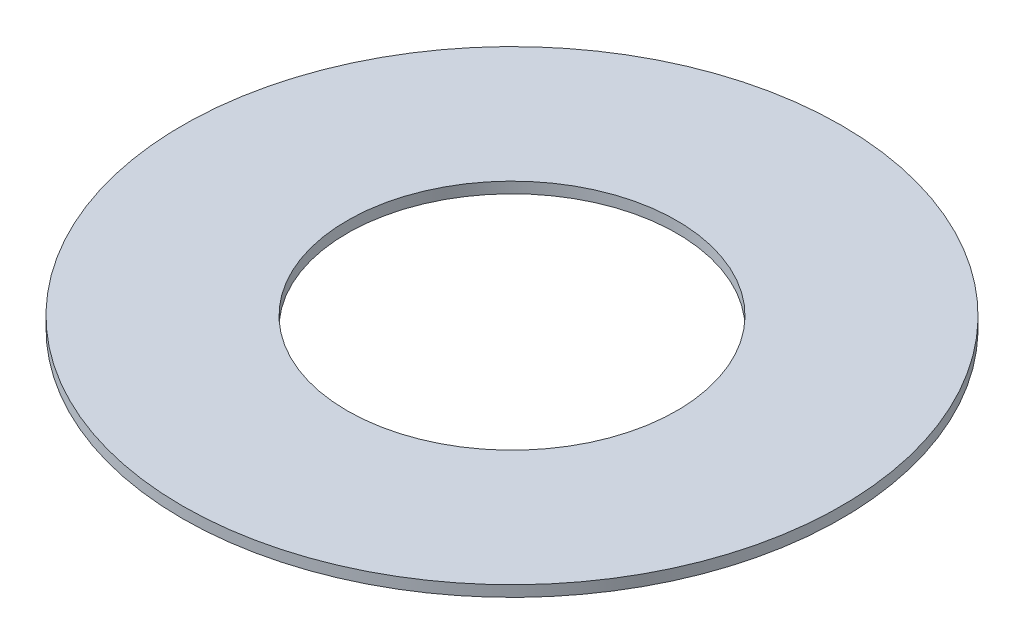
ISO-10303-21;
HEADER;
FILE_DESCRIPTION(('STEP AP214'),'2;1');
FILE_NAME('part.step','',(''),(''),'','','');
FILE_SCHEMA(('AUTOMOTIVE_DESIGN { 1 0 10303 214 1 1 1 1 }'));
ENDSEC;
DATA;
#1=APPLICATION_CONTEXT('core data for automotive mechanical design processes');
#2=APPLICATION_PROTOCOL_DEFINITION('international standard','automotive_design',2000,#1);
#3=PRODUCT_CONTEXT('',#1,'mechanical');
#4=PRODUCT('Part','Part','',(#3));
#5=PRODUCT_RELATED_PRODUCT_CATEGORY('part','',(#4));
#6=PRODUCT_DEFINITION_FORMATION('','',#4);
#7=PRODUCT_DEFINITION_CONTEXT('part definition',#1,'design');
#8=PRODUCT_DEFINITION('design','',#6,#7);
#9=PRODUCT_DEFINITION_SHAPE('','',#8);
#10=(LENGTH_UNIT() NAMED_UNIT(*) SI_UNIT(.MILLI.,.METRE.));
#11=(NAMED_UNIT(*) PLANE_ANGLE_UNIT() SI_UNIT($,.RADIAN.));
#12=(NAMED_UNIT(*) SI_UNIT($,.STERADIAN.) SOLID_ANGLE_UNIT());
#13=UNCERTAINTY_MEASURE_WITH_UNIT(LENGTH_MEASURE(1.E-05),#10,'distance_accuracy_value','');
#14=(GEOMETRIC_REPRESENTATION_CONTEXT(3) GLOBAL_UNCERTAINTY_ASSIGNED_CONTEXT((#13)) GLOBAL_UNIT_ASSIGNED_CONTEXT((#10,
#11,#12)) REPRESENTATION_CONTEXT('',''));
#15=CARTESIAN_POINT('',(0.,0.,0.));
#16=DIRECTION('',(0.,0.,1.));
#17=DIRECTION('',(1.,0.,0.));
#18=AXIS2_PLACEMENT_3D('',#15,#16,#17);
#19=CARTESIAN_POINT('',(0.,0.199999999999978,0.));
#20=DIRECTION('',(0.,-1.,0.));
#21=DIRECTION('',(0.,0.,-1.));
#22=AXIS2_PLACEMENT_3D('',#19,#20,#21);
#23=CYLINDRICAL_SURFACE('',#22,6.);
#24=CARTESIAN_POINT('',(0.,0.199999999999978,0.));
#25=DIRECTION('',(0.,1.,0.));
#26=DIRECTION('',(0.,0.,1.));
#27=AXIS2_PLACEMENT_3D('',#24,#25,#26);
#28=CIRCLE('',#27,6.);
#29=CARTESIAN_POINT('',(0.,0.199999999999978,6.));
#30=VERTEX_POINT('',#29);
#31=EDGE_CURVE('E10',#30,#30,#28,.T.);
#32=ORIENTED_EDGE('',*,*,#31,.F.);
#33=EDGE_LOOP('',(#32));
#34=FACE_BOUND('',#33,.T.);
#35=CARTESIAN_POINT('',(0.,0.,0.));
#36=DIRECTION('',(0.,1.,0.));
#37=DIRECTION('',(0.,0.,1.));
#38=AXIS2_PLACEMENT_3D('',#35,#36,#37);
#39=CIRCLE('',#38,6.);
#40=CARTESIAN_POINT('',(0.,0.,6.));
#41=VERTEX_POINT('',#40);
#42=EDGE_CURVE('E35',#41,#41,#39,.T.);
#43=ORIENTED_EDGE('',*,*,#42,.T.);
#44=EDGE_LOOP('',(#43));
#45=FACE_BOUND('',#44,.T.);
#46=ADVANCED_FACE('F32',(#34,#45),#23,.T.);
#47=CARTESIAN_POINT('',(0.,0.199999999999978,0.));
#48=DIRECTION('',(0.,1.,0.));
#49=DIRECTION('',(0.,0.,1.));
#50=AXIS2_PLACEMENT_3D('',#47,#48,#49);
#51=PLANE('',#50);
#52=CARTESIAN_POINT('',(0.,0.199999999999978,0.));
#53=DIRECTION('',(0.,1.,0.));
#54=DIRECTION('',(0.,0.,1.));
#55=AXIS2_PLACEMENT_3D('',#52,#53,#54);
#56=CIRCLE('',#55,3.);
#57=CARTESIAN_POINT('',(0.,0.199999999999978,3.));
#58=VERTEX_POINT('',#57);
#59=EDGE_CURVE('E44',#58,#58,#56,.T.);
#60=ORIENTED_EDGE('',*,*,#59,.F.);
#61=EDGE_LOOP('',(#60));
#62=FACE_BOUND('',#61,.T.);
#63=ORIENTED_EDGE('',*,*,#31,.T.);
#64=EDGE_LOOP('',(#63));
#65=FACE_BOUND('',#64,.T.);
#66=ADVANCED_FACE('F59',(#62,#65),#51,.T.);
#67=CARTESIAN_POINT('',(0.,0.,0.));
#68=DIRECTION('',(0.,1.,0.));
#69=DIRECTION('',(0.,0.,1.));
#70=AXIS2_PLACEMENT_3D('',#67,#68,#69);
#71=PLANE('',#70);
#72=CARTESIAN_POINT('',(0.,0.,0.));
#73=DIRECTION('',(0.,1.,0.));
#74=DIRECTION('',(0.,0.,1.));
#75=AXIS2_PLACEMENT_3D('',#72,#73,#74);
#76=CIRCLE('',#75,3.);
#77=CARTESIAN_POINT('',(0.,0.,3.));
#78=VERTEX_POINT('',#77);
#79=EDGE_CURVE('E42',#78,#78,#76,.T.);
#80=ORIENTED_EDGE('',*,*,#79,.T.);
#81=EDGE_LOOP('',(#80));
#82=FACE_BOUND('',#81,.T.);
#83=ORIENTED_EDGE('',*,*,#42,.F.);
#84=EDGE_LOOP('',(#83));
#85=FACE_BOUND('',#84,.T.);
#86=ADVANCED_FACE('F50',(#82,#85),#71,.F.);
#87=CARTESIAN_POINT('',(0.,0.,0.));
#88=DIRECTION('',(0.,1.,0.));
#89=DIRECTION('',(0.,0.,1.));
#90=AXIS2_PLACEMENT_3D('',#87,#88,#89);
#91=CYLINDRICAL_SURFACE('',#90,3.);
#92=ORIENTED_EDGE('',*,*,#79,.F.);
#93=EDGE_LOOP('',(#92));
#94=FACE_BOUND('',#93,.T.);
#95=ORIENTED_EDGE('',*,*,#59,.T.);
#96=EDGE_LOOP('',(#95));
#97=FACE_BOUND('',#96,.T.);
#98=ADVANCED_FACE('F53',(#94,#97),#91,.F.);
#99=CLOSED_SHELL('',(#46,#66,#86,#98));
#100=MANIFOLD_SOLID_BREP('B2',#99);
#101=ADVANCED_BREP_SHAPE_REPRESENTATION('',(#18,#100),#14);
#102=SHAPE_DEFINITION_REPRESENTATION(#9,#101);
ENDSEC;
END-ISO-10303-21;
